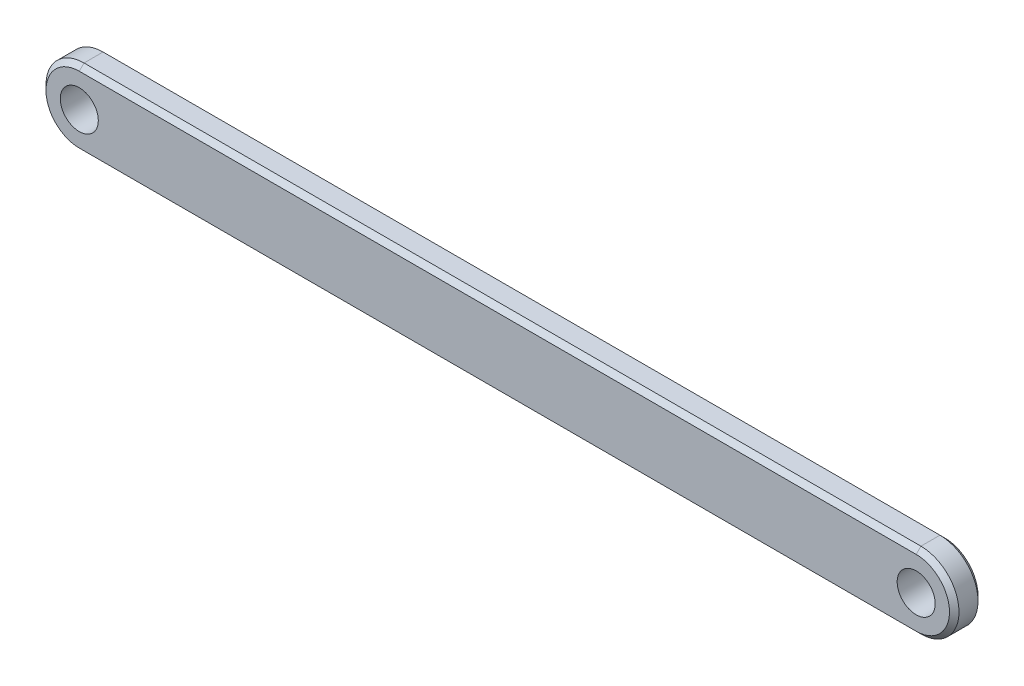
ISO-10303-21;
HEADER;
FILE_DESCRIPTION(('STEP AP214'),'2;1');
FILE_NAME('part.step','',(''),(''),'','','');
FILE_SCHEMA(('AUTOMOTIVE_DESIGN { 1 0 10303 214 1 1 1 1 }'));
ENDSEC;
DATA;
#1=APPLICATION_CONTEXT('core data for automotive mechanical design processes');
#2=APPLICATION_PROTOCOL_DEFINITION('international standard','automotive_design',2000,#1);
#3=PRODUCT_CONTEXT('',#1,'mechanical');
#4=PRODUCT('Part','Part','',(#3));
#5=PRODUCT_RELATED_PRODUCT_CATEGORY('part','',(#4));
#6=PRODUCT_DEFINITION_FORMATION('','',#4);
#7=PRODUCT_DEFINITION_CONTEXT('part definition',#1,'design');
#8=PRODUCT_DEFINITION('design','',#6,#7);
#9=PRODUCT_DEFINITION_SHAPE('','',#8);
#10=(LENGTH_UNIT() NAMED_UNIT(*) SI_UNIT(.MILLI.,.METRE.));
#11=(NAMED_UNIT(*) PLANE_ANGLE_UNIT() SI_UNIT($,.RADIAN.));
#12=(NAMED_UNIT(*) SI_UNIT($,.STERADIAN.) SOLID_ANGLE_UNIT());
#13=UNCERTAINTY_MEASURE_WITH_UNIT(LENGTH_MEASURE(1.E-05),#10,'distance_accuracy_value','');
#14=(GEOMETRIC_REPRESENTATION_CONTEXT(3) GLOBAL_UNCERTAINTY_ASSIGNED_CONTEXT((#13)) GLOBAL_UNIT_ASSIGNED_CONTEXT((#10,
#11,#12)) REPRESENTATION_CONTEXT('',''));
#15=CARTESIAN_POINT('',(0.,0.,0.));
#16=DIRECTION('',(0.,0.,1.));
#17=DIRECTION('',(1.,0.,0.));
#18=AXIS2_PLACEMENT_3D('',#15,#16,#17);
#19=CARTESIAN_POINT('',(39.7090919371254,0.,1.5));
#20=DIRECTION('',(0.,0.,1.));
#21=DIRECTION('',(1.,0.,0.));
#22=AXIS2_PLACEMENT_3D('',#19,#20,#21);
#23=PLANE('',#22);
#24=DIRECTION('',(-1.,0.,0.));
#25=VECTOR('',#24,1.);
#26=CARTESIAN_POINT('',(-48.2909080628746,3.49999999999999,1.5));
#27=LINE('',#26,#25);
#28=CARTESIAN_POINT('',(39.7090919371254,3.5,1.5));
#29=VERTEX_POINT('',#28);
#30=CARTESIAN_POINT('',(-48.2909080628746,3.49999999999999,1.5));
#31=VERTEX_POINT('',#30);
#32=EDGE_CURVE('E60',#29,#31,#27,.T.);
#33=ORIENTED_EDGE('',*,*,#32,.T.);
#34=CARTESIAN_POINT('',(-48.2909080628746,0.,1.5));
#35=DIRECTION('',(0.,0.,1.));
#36=DIRECTION('',(1.,0.,0.));
#37=AXIS2_PLACEMENT_3D('',#34,#35,#36);
#38=CIRCLE('',#37,3.5);
#39=CARTESIAN_POINT('',(-48.2909080628746,-3.50000000000001,1.5));
#40=VERTEX_POINT('',#39);
#41=EDGE_CURVE('E11',#31,#40,#38,.T.);
#42=ORIENTED_EDGE('',*,*,#41,.T.);
#43=DIRECTION('',(1.,0.,0.));
#44=VECTOR('',#43,1.);
#45=CARTESIAN_POINT('',(39.7090919371254,-3.5,1.5));
#46=LINE('',#45,#44);
#47=CARTESIAN_POINT('',(39.7090919371254,-3.5,1.5));
#48=VERTEX_POINT('',#47);
#49=EDGE_CURVE('E45',#40,#48,#46,.T.);
#50=ORIENTED_EDGE('',*,*,#49,.T.);
#51=CARTESIAN_POINT('',(39.7090919371254,0.,1.5));
#52=DIRECTION('',(0.,0.,1.));
#53=DIRECTION('',(1.,0.,0.));
#54=AXIS2_PLACEMENT_3D('',#51,#52,#53);
#55=CIRCLE('',#54,3.5);
#56=EDGE_CURVE('E200',#48,#29,#55,.T.);
#57=ORIENTED_EDGE('',*,*,#56,.T.);
#58=EDGE_LOOP('',(#33,#42,#50,#57));
#59=FACE_BOUND('',#58,.T.);
#60=CARTESIAN_POINT('',(-48.2909080628746,0.,1.5));
#61=DIRECTION('',(0.,0.,1.));
#62=DIRECTION('',(1.,0.,0.));
#63=AXIS2_PLACEMENT_3D('',#60,#61,#62);
#64=CIRCLE('',#63,2.);
#65=CARTESIAN_POINT('',(-46.2909080628746,0.,1.5));
#66=VERTEX_POINT('',#65);
#67=EDGE_CURVE('E173',#66,#66,#64,.T.);
#68=ORIENTED_EDGE('',*,*,#67,.F.);
#69=EDGE_LOOP('',(#68));
#70=FACE_BOUND('',#69,.T.);
#71=CARTESIAN_POINT('',(39.7090919371254,0.,1.5));
#72=DIRECTION('',(0.,0.,1.));
#73=DIRECTION('',(1.,0.,0.));
#74=AXIS2_PLACEMENT_3D('',#71,#72,#73);
#75=CIRCLE('',#74,2.);
#76=CARTESIAN_POINT('',(41.7090919371254,0.,1.5));
#77=VERTEX_POINT('',#76);
#78=EDGE_CURVE('E165',#77,#77,#75,.T.);
#79=ORIENTED_EDGE('',*,*,#78,.F.);
#80=EDGE_LOOP('',(#79));
#81=FACE_BOUND('',#80,.T.);
#82=ADVANCED_FACE('F35',(#59,#70,#81),#23,.T.);
#83=CARTESIAN_POINT('',(39.7090919371254,0.,-1.5));
#84=DIRECTION('',(0.,0.,1.));
#85=DIRECTION('',(1.,0.,0.));
#86=AXIS2_PLACEMENT_3D('',#83,#84,#85);
#87=PLANE('',#86);
#88=DIRECTION('',(-1.,0.,0.));
#89=VECTOR('',#88,1.);
#90=CARTESIAN_POINT('',(39.7090919371254,-3.5,-1.5));
#91=LINE('',#90,#89);
#92=CARTESIAN_POINT('',(39.7090919371254,-3.5,-1.5));
#93=VERTEX_POINT('',#92);
#94=CARTESIAN_POINT('',(-48.2909080628746,-3.50000000000001,-1.5));
#95=VERTEX_POINT('',#94);
#96=EDGE_CURVE('E187',#93,#95,#91,.T.);
#97=ORIENTED_EDGE('',*,*,#96,.T.);
#98=CARTESIAN_POINT('',(-48.2909080628746,0.,-1.5));
#99=DIRECTION('',(0.,0.,1.));
#100=DIRECTION('',(1.,0.,0.));
#101=AXIS2_PLACEMENT_3D('',#98,#99,#100);
#102=CIRCLE('',#101,3.5);
#103=CARTESIAN_POINT('',(-48.2909080628746,3.49999999999999,-1.5));
#104=VERTEX_POINT('',#103);
#105=EDGE_CURVE('E116',#95,#104,#102,.F.);
#106=ORIENTED_EDGE('',*,*,#105,.T.);
#107=DIRECTION('',(1.,0.,0.));
#108=VECTOR('',#107,1.);
#109=CARTESIAN_POINT('',(39.7090919371254,3.5,-1.5));
#110=LINE('',#109,#108);
#111=CARTESIAN_POINT('',(39.7090919371254,3.5,-1.5));
#112=VERTEX_POINT('',#111);
#113=EDGE_CURVE('E185',#104,#112,#110,.T.);
#114=ORIENTED_EDGE('',*,*,#113,.T.);
#115=CARTESIAN_POINT('',(39.7090919371254,0.,-1.5));
#116=DIRECTION('',(0.,0.,1.));
#117=DIRECTION('',(1.,0.,0.));
#118=AXIS2_PLACEMENT_3D('',#115,#116,#117);
#119=CIRCLE('',#118,3.5);
#120=EDGE_CURVE('E183',#112,#93,#119,.F.);
#121=ORIENTED_EDGE('',*,*,#120,.T.);
#122=EDGE_LOOP('',(#97,#106,#114,#121));
#123=FACE_BOUND('',#122,.T.);
#124=CARTESIAN_POINT('',(-48.2909080628746,0.,-1.5));
#125=DIRECTION('',(0.,0.,1.));
#126=DIRECTION('',(1.,0.,0.));
#127=AXIS2_PLACEMENT_3D('',#124,#125,#126);
#128=CIRCLE('',#127,2.);
#129=CARTESIAN_POINT('',(-46.2909080628746,0.,-1.5));
#130=VERTEX_POINT('',#129);
#131=EDGE_CURVE('E170',#130,#130,#128,.T.);
#132=ORIENTED_EDGE('',*,*,#131,.T.);
#133=EDGE_LOOP('',(#132));
#134=FACE_BOUND('',#133,.T.);
#135=CARTESIAN_POINT('',(39.7090919371254,0.,-1.5));
#136=DIRECTION('',(0.,0.,1.));
#137=DIRECTION('',(1.,0.,0.));
#138=AXIS2_PLACEMENT_3D('',#135,#136,#137);
#139=CIRCLE('',#138,2.);
#140=CARTESIAN_POINT('',(41.7090919371254,0.,-1.5));
#141=VERTEX_POINT('',#140);
#142=EDGE_CURVE('E159',#141,#141,#139,.T.);
#143=ORIENTED_EDGE('',*,*,#142,.T.);
#144=EDGE_LOOP('',(#143));
#145=FACE_BOUND('',#144,.T.);
#146=ADVANCED_FACE('F230',(#123,#134,#145),#87,.F.);
#147=CARTESIAN_POINT('',(39.7090919371254,0.,1.5));
#148=DIRECTION('',(0.,0.,-1.));
#149=DIRECTION('',(-1.,0.,0.));
#150=AXIS2_PLACEMENT_3D('',#147,#148,#149);
#151=CYLINDRICAL_SURFACE('',#150,4.);
#152=DIRECTION('',(0.,0.,-1.));
#153=VECTOR('',#152,1.);
#154=CARTESIAN_POINT('',(39.7090919371254,-4.,1.5));
#155=LINE('',#154,#153);
#156=CARTESIAN_POINT('',(39.7090919371254,-4.,1.));
#157=VERTEX_POINT('',#156);
#158=CARTESIAN_POINT('',(39.7090919371254,-4.,-1.00000000000002));
#159=VERTEX_POINT('',#158);
#160=EDGE_CURVE('E111',#157,#159,#155,.T.);
#161=ORIENTED_EDGE('',*,*,#160,.T.);
#162=CARTESIAN_POINT('',(39.7090919371254,0.,-1.00000000000002));
#163=DIRECTION('',(0.,0.,1.));
#164=DIRECTION('',(1.,0.,0.));
#165=AXIS2_PLACEMENT_3D('',#162,#163,#164);
#166=CIRCLE('',#165,4.);
#167=CARTESIAN_POINT('',(39.7090919371254,4.,-1.00000000000002));
#168=VERTEX_POINT('',#167);
#169=EDGE_CURVE('E198',#159,#168,#166,.T.);
#170=ORIENTED_EDGE('',*,*,#169,.T.);
#171=DIRECTION('',(0.,0.,-1.));
#172=VECTOR('',#171,1.);
#173=CARTESIAN_POINT('',(39.7090919371254,4.,1.5));
#174=LINE('',#173,#172);
#175=CARTESIAN_POINT('',(39.7090919371254,4.,1.));
#176=VERTEX_POINT('',#175);
#177=EDGE_CURVE('E132',#176,#168,#174,.T.);
#178=ORIENTED_EDGE('',*,*,#177,.F.);
#179=CARTESIAN_POINT('',(39.7090919371254,0.,1.));
#180=DIRECTION('',(0.,0.,1.));
#181=DIRECTION('',(1.,0.,0.));
#182=AXIS2_PLACEMENT_3D('',#179,#180,#181);
#183=CIRCLE('',#182,4.);
#184=EDGE_CURVE('E196',#176,#157,#183,.F.);
#185=ORIENTED_EDGE('',*,*,#184,.T.);
#186=EDGE_LOOP('',(#161,#170,#178,#185));
#187=FACE_BOUND('',#186,.T.);
#188=ADVANCED_FACE('F211',(#187),#151,.T.);
#189=CARTESIAN_POINT('',(39.7090919371254,4.,1.5));
#190=DIRECTION('',(0.,-1.,0.));
#191=DIRECTION('',(1.,0.,0.));
#192=AXIS2_PLACEMENT_3D('',#189,#190,#191);
#193=PLANE('',#192);
#194=ORIENTED_EDGE('',*,*,#177,.T.);
#195=DIRECTION('',(-1.,0.,0.));
#196=VECTOR('',#195,1.);
#197=CARTESIAN_POINT('',(39.7090919371254,4.,-1.00000000000002));
#198=LINE('',#197,#196);
#199=CARTESIAN_POINT('',(-48.2909080628746,4.,-1.00000000000002));
#200=VERTEX_POINT('',#199);
#201=EDGE_CURVE('E194',#168,#200,#198,.T.);
#202=ORIENTED_EDGE('',*,*,#201,.T.);
#203=DIRECTION('',(0.,0.,-1.));
#204=VECTOR('',#203,1.);
#205=CARTESIAN_POINT('',(-48.2909080628746,4.,1.5));
#206=LINE('',#205,#204);
#207=CARTESIAN_POINT('',(-48.2909080628746,4.,1.));
#208=VERTEX_POINT('',#207);
#209=EDGE_CURVE('E127',#208,#200,#206,.T.);
#210=ORIENTED_EDGE('',*,*,#209,.F.);
#211=DIRECTION('',(1.,0.,0.));
#212=VECTOR('',#211,1.);
#213=CARTESIAN_POINT('',(39.7090919371254,4.,1.));
#214=LINE('',#213,#212);
#215=EDGE_CURVE('E192',#208,#176,#214,.T.);
#216=ORIENTED_EDGE('',*,*,#215,.T.);
#217=EDGE_LOOP('',(#194,#202,#210,#216));
#218=FACE_BOUND('',#217,.T.);
#219=ADVANCED_FACE('F209',(#218),#193,.F.);
#220=CARTESIAN_POINT('',(-48.2909080628746,0.,1.5));
#221=DIRECTION('',(0.,0.,-1.));
#222=DIRECTION('',(-1.,0.,0.));
#223=AXIS2_PLACEMENT_3D('',#220,#221,#222);
#224=CYLINDRICAL_SURFACE('',#223,4.);
#225=ORIENTED_EDGE('',*,*,#209,.T.);
#226=CARTESIAN_POINT('',(-48.2909080628746,0.,-1.00000000000002));
#227=DIRECTION('',(0.,0.,1.));
#228=DIRECTION('',(1.,0.,0.));
#229=AXIS2_PLACEMENT_3D('',#226,#227,#228);
#230=CIRCLE('',#229,4.);
#231=CARTESIAN_POINT('',(-48.2909080628746,-4.00000000000001,-1.00000000000002));
#232=VERTEX_POINT('',#231);
#233=EDGE_CURVE('E126',#200,#232,#230,.T.);
#234=ORIENTED_EDGE('',*,*,#233,.T.);
#235=DIRECTION('',(0.,0.,-1.));
#236=VECTOR('',#235,1.);
#237=CARTESIAN_POINT('',(-48.2909080628746,-4.00000000000001,1.5));
#238=LINE('',#237,#236);
#239=CARTESIAN_POINT('',(-48.2909080628746,-4.00000000000001,1.));
#240=VERTEX_POINT('',#239);
#241=EDGE_CURVE('E109',#240,#232,#238,.T.);
#242=ORIENTED_EDGE('',*,*,#241,.F.);
#243=CARTESIAN_POINT('',(-48.2909080628746,0.,1.));
#244=DIRECTION('',(0.,0.,1.));
#245=DIRECTION('',(1.,0.,0.));
#246=AXIS2_PLACEMENT_3D('',#243,#244,#245);
#247=CIRCLE('',#246,4.);
#248=EDGE_CURVE('E123',#240,#208,#247,.F.);
#249=ORIENTED_EDGE('',*,*,#248,.T.);
#250=EDGE_LOOP('',(#225,#234,#242,#249));
#251=FACE_BOUND('',#250,.T.);
#252=ADVANCED_FACE('F122',(#251),#224,.T.);
#253=CARTESIAN_POINT('',(39.7090919371254,-4.,1.5));
#254=DIRECTION('',(0.,1.,0.));
#255=DIRECTION('',(-1.,0.,0.));
#256=AXIS2_PLACEMENT_3D('',#253,#254,#255);
#257=PLANE('',#256);
#258=ORIENTED_EDGE('',*,*,#241,.T.);
#259=DIRECTION('',(1.,0.,0.));
#260=VECTOR('',#259,1.);
#261=CARTESIAN_POINT('',(39.7090919371254,-4.,-1.00000000000002));
#262=LINE('',#261,#260);
#263=EDGE_CURVE('E115',#232,#159,#262,.T.);
#264=ORIENTED_EDGE('',*,*,#263,.T.);
#265=ORIENTED_EDGE('',*,*,#160,.F.);
#266=DIRECTION('',(-1.,0.,0.));
#267=VECTOR('',#266,1.);
#268=CARTESIAN_POINT('',(-48.2909080628746,-4.00000000000001,1.));
#269=LINE('',#268,#267);
#270=EDGE_CURVE('E106',#157,#240,#269,.T.);
#271=ORIENTED_EDGE('',*,*,#270,.T.);
#272=EDGE_LOOP('',(#258,#264,#265,#271));
#273=FACE_BOUND('',#272,.T.);
#274=ADVANCED_FACE('F108',(#273),#257,.F.);
#275=CARTESIAN_POINT('',(-48.2909080628746,0.,1.5));
#276=DIRECTION('',(0.,0.,-1.));
#277=DIRECTION('',(-1.,0.,0.));
#278=AXIS2_PLACEMENT_3D('',#275,#276,#277);
#279=CYLINDRICAL_SURFACE('',#278,2.);
#280=ORIENTED_EDGE('',*,*,#67,.T.);
#281=EDGE_LOOP('',(#280));
#282=FACE_BOUND('',#281,.T.);
#283=ORIENTED_EDGE('',*,*,#131,.F.);
#284=EDGE_LOOP('',(#283));
#285=FACE_BOUND('',#284,.T.);
#286=ADVANCED_FACE('F238',(#282,#285),#279,.F.);
#287=CARTESIAN_POINT('',(39.7090919371254,0.,1.5));
#288=DIRECTION('',(0.,0.,-1.));
#289=DIRECTION('',(-1.,0.,0.));
#290=AXIS2_PLACEMENT_3D('',#287,#288,#289);
#291=CYLINDRICAL_SURFACE('',#290,2.);
#292=ORIENTED_EDGE('',*,*,#78,.T.);
#293=EDGE_LOOP('',(#292));
#294=FACE_BOUND('',#293,.T.);
#295=ORIENTED_EDGE('',*,*,#142,.F.);
#296=EDGE_LOOP('',(#295));
#297=FACE_BOUND('',#296,.T.);
#298=ADVANCED_FACE('F270',(#294,#297),#291,.F.);
#299=CARTESIAN_POINT('',(39.7090919371254,0.,-1.00000000000002));
#300=DIRECTION('',(0.,0.,1.));
#301=DIRECTION('',(1.,0.,0.));
#302=AXIS2_PLACEMENT_3D('',#299,#300,#301);
#303=CONICAL_SURFACE('',#302,4.,0.785398163397465);
#304=DIRECTION('',(0.,-0.707106781186559,0.707106781186536));
#305=VECTOR('',#304,1.);
#306=CARTESIAN_POINT('',(39.7090919371254,-3.5,-1.5));
#307=LINE('',#306,#305);
#308=EDGE_CURVE('E151',#93,#159,#307,.T.);
#309=ORIENTED_EDGE('',*,*,#308,.F.);
#310=ORIENTED_EDGE('',*,*,#120,.F.);
#311=DIRECTION('',(0.,-0.707106781186559,-0.707106781186536));
#312=VECTOR('',#311,1.);
#313=CARTESIAN_POINT('',(39.7090919371254,4.,-1.00000000000002));
#314=LINE('',#313,#312);
#315=EDGE_CURVE('E139',#168,#112,#314,.T.);
#316=ORIENTED_EDGE('',*,*,#315,.F.);
#317=ORIENTED_EDGE('',*,*,#169,.F.);
#318=EDGE_LOOP('',(#309,#310,#316,#317));
#319=FACE_BOUND('',#318,.T.);
#320=ADVANCED_FACE('F214',(#319),#303,.T.);
#321=CARTESIAN_POINT('',(39.7090919371254,4.,-1.00000000000002));
#322=DIRECTION('',(0.,-0.707106781186536,0.707106781186559));
#323=DIRECTION('',(-1.,0.,0.));
#324=AXIS2_PLACEMENT_3D('',#321,#322,#323);
#325=PLANE('',#324);
#326=ORIENTED_EDGE('',*,*,#315,.T.);
#327=ORIENTED_EDGE('',*,*,#113,.F.);
#328=DIRECTION('',(0.,-0.707106781186559,-0.707106781186536));
#329=VECTOR('',#328,1.);
#330=CARTESIAN_POINT('',(-48.2909080628746,3.99999999999999,-1.00000000000002));
#331=LINE('',#330,#329);
#332=EDGE_CURVE('E145',#200,#104,#331,.T.);
#333=ORIENTED_EDGE('',*,*,#332,.F.);
#334=ORIENTED_EDGE('',*,*,#201,.F.);
#335=EDGE_LOOP('',(#326,#327,#333,#334));
#336=FACE_BOUND('',#335,.T.);
#337=ADVANCED_FACE('F217',(#336),#325,.F.);
#338=CARTESIAN_POINT('',(39.7090919371254,-4.,-1.00000000000002));
#339=DIRECTION('',(0.,0.707106781186536,0.707106781186559));
#340=DIRECTION('',(1.,0.,0.));
#341=AXIS2_PLACEMENT_3D('',#338,#339,#340);
#342=PLANE('',#341);
#343=ORIENTED_EDGE('',*,*,#308,.T.);
#344=ORIENTED_EDGE('',*,*,#263,.F.);
#345=DIRECTION('',(0.,-0.707106781186559,0.707106781186536));
#346=VECTOR('',#345,1.);
#347=CARTESIAN_POINT('',(-48.2909080628746,-3.50000000000001,-1.5));
#348=LINE('',#347,#346);
#349=EDGE_CURVE('E142',#95,#232,#348,.T.);
#350=ORIENTED_EDGE('',*,*,#349,.F.);
#351=ORIENTED_EDGE('',*,*,#96,.F.);
#352=EDGE_LOOP('',(#343,#344,#350,#351));
#353=FACE_BOUND('',#352,.T.);
#354=ADVANCED_FACE('F220',(#353),#342,.F.);
#355=CARTESIAN_POINT('',(-48.2909080628746,0.,-1.00000000000002));
#356=DIRECTION('',(0.,0.,1.));
#357=DIRECTION('',(1.,0.,0.));
#358=AXIS2_PLACEMENT_3D('',#355,#356,#357);
#359=CONICAL_SURFACE('',#358,4.,0.785398163397465);
#360=ORIENTED_EDGE('',*,*,#332,.T.);
#361=ORIENTED_EDGE('',*,*,#105,.F.);
#362=ORIENTED_EDGE('',*,*,#349,.T.);
#363=ORIENTED_EDGE('',*,*,#233,.F.);
#364=EDGE_LOOP('',(#360,#361,#362,#363));
#365=FACE_BOUND('',#364,.T.);
#366=ADVANCED_FACE('F218',(#365),#359,.T.);
#367=CARTESIAN_POINT('',(39.7090919371254,0.,1.5));
#368=DIRECTION('',(0.,0.,-1.));
#369=DIRECTION('',(-1.,0.,0.));
#370=AXIS2_PLACEMENT_3D('',#367,#368,#369);
#371=CONICAL_SURFACE('',#370,3.5,0.785398163397451);
#372=DIRECTION('',(0.,0.707106781186549,0.707106781186546));
#373=VECTOR('',#372,1.);
#374=CARTESIAN_POINT('',(39.7090919371254,-4.,1.));
#375=LINE('',#374,#373);
#376=EDGE_CURVE('E136',#157,#48,#375,.T.);
#377=ORIENTED_EDGE('',*,*,#376,.F.);
#378=ORIENTED_EDGE('',*,*,#184,.F.);
#379=DIRECTION('',(0.,0.707106781186549,-0.707106781186546));
#380=VECTOR('',#379,1.);
#381=CARTESIAN_POINT('',(39.7090919371254,3.5,1.5));
#382=LINE('',#381,#380);
#383=EDGE_CURVE('E40',#29,#176,#382,.T.);
#384=ORIENTED_EDGE('',*,*,#383,.F.);
#385=ORIENTED_EDGE('',*,*,#56,.F.);
#386=EDGE_LOOP('',(#377,#378,#384,#385));
#387=FACE_BOUND('',#386,.T.);
#388=ADVANCED_FACE('F38',(#387),#371,.T.);
#389=CARTESIAN_POINT('',(39.7090919371254,3.5,1.5));
#390=DIRECTION('',(0.,0.707106781186546,0.707106781186549));
#391=DIRECTION('',(1.,0.,0.));
#392=AXIS2_PLACEMENT_3D('',#389,#390,#391);
#393=PLANE('',#392);
#394=ORIENTED_EDGE('',*,*,#383,.T.);
#395=ORIENTED_EDGE('',*,*,#215,.F.);
#396=DIRECTION('',(0.,0.707106781186549,-0.707106781186546));
#397=VECTOR('',#396,1.);
#398=CARTESIAN_POINT('',(-48.2909080628746,3.49999999999999,1.5));
#399=LINE('',#398,#397);
#400=EDGE_CURVE('E130',#31,#208,#399,.T.);
#401=ORIENTED_EDGE('',*,*,#400,.F.);
#402=ORIENTED_EDGE('',*,*,#32,.F.);
#403=EDGE_LOOP('',(#394,#395,#401,#402));
#404=FACE_BOUND('',#403,.T.);
#405=ADVANCED_FACE('F206',(#404),#393,.T.);
#406=CARTESIAN_POINT('',(39.7090919371254,-3.5,1.5));
#407=DIRECTION('',(0.,-0.707106781186546,0.707106781186549));
#408=DIRECTION('',(-1.,0.,0.));
#409=AXIS2_PLACEMENT_3D('',#406,#407,#408);
#410=PLANE('',#409);
#411=ORIENTED_EDGE('',*,*,#376,.T.);
#412=ORIENTED_EDGE('',*,*,#49,.F.);
#413=DIRECTION('',(0.,0.707106781186549,0.707106781186546));
#414=VECTOR('',#413,1.);
#415=CARTESIAN_POINT('',(-48.2909080628746,-4.00000000000001,1.));
#416=LINE('',#415,#414);
#417=EDGE_CURVE('E53',#240,#40,#416,.T.);
#418=ORIENTED_EDGE('',*,*,#417,.F.);
#419=ORIENTED_EDGE('',*,*,#270,.F.);
#420=EDGE_LOOP('',(#411,#412,#418,#419));
#421=FACE_BOUND('',#420,.T.);
#422=ADVANCED_FACE('F134',(#421),#410,.T.);
#423=CARTESIAN_POINT('',(-48.2909080628746,0.,1.5));
#424=DIRECTION('',(0.,0.,-1.));
#425=DIRECTION('',(-1.,0.,0.));
#426=AXIS2_PLACEMENT_3D('',#423,#424,#425);
#427=CONICAL_SURFACE('',#426,3.5,0.785398163397451);
#428=ORIENTED_EDGE('',*,*,#400,.T.);
#429=ORIENTED_EDGE('',*,*,#248,.F.);
#430=ORIENTED_EDGE('',*,*,#417,.T.);
#431=ORIENTED_EDGE('',*,*,#41,.F.);
#432=EDGE_LOOP('',(#428,#429,#430,#431));
#433=FACE_BOUND('',#432,.T.);
#434=ADVANCED_FACE('F129',(#433),#427,.T.);
#435=CLOSED_SHELL('',(#82,#146,#188,#219,#252,#274,#286,#298,#320,#337,#354,#366,#388,#405,#422,#434));
#436=MANIFOLD_SOLID_BREP('B2',#435);
#437=ADVANCED_BREP_SHAPE_REPRESENTATION('',(#18,#436),#14);
#438=SHAPE_DEFINITION_REPRESENTATION(#9,#437);
ENDSEC;
END-ISO-10303-21;
